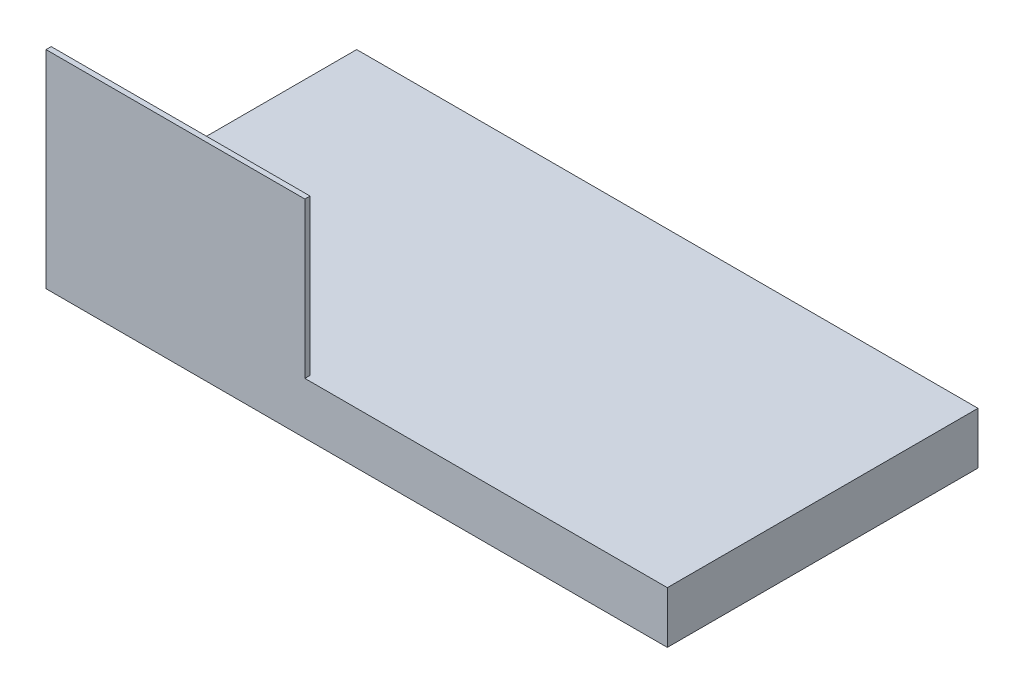
ISO-10303-21;
HEADER;
FILE_DESCRIPTION(('STEP AP214'),'2;1');
FILE_NAME('part.step','',(''),(''),'','','');
FILE_SCHEMA(('AUTOMOTIVE_DESIGN { 1 0 10303 214 1 1 1 1 }'));
ENDSEC;
DATA;
#1=APPLICATION_CONTEXT('core data for automotive mechanical design processes');
#2=APPLICATION_PROTOCOL_DEFINITION('international standard','automotive_design',2000,#1);
#3=PRODUCT_CONTEXT('',#1,'mechanical');
#4=PRODUCT('Part','Part','',(#3));
#5=PRODUCT_RELATED_PRODUCT_CATEGORY('part','',(#4));
#6=PRODUCT_DEFINITION_FORMATION('','',#4);
#7=PRODUCT_DEFINITION_CONTEXT('part definition',#1,'design');
#8=PRODUCT_DEFINITION('design','',#6,#7);
#9=PRODUCT_DEFINITION_SHAPE('','',#8);
#10=(LENGTH_UNIT() NAMED_UNIT(*) SI_UNIT(.MILLI.,.METRE.));
#11=(NAMED_UNIT(*) PLANE_ANGLE_UNIT() SI_UNIT($,.RADIAN.));
#12=(NAMED_UNIT(*) SI_UNIT($,.STERADIAN.) SOLID_ANGLE_UNIT());
#13=UNCERTAINTY_MEASURE_WITH_UNIT(LENGTH_MEASURE(1.E-05),#10,'distance_accuracy_value','');
#14=(GEOMETRIC_REPRESENTATION_CONTEXT(3) GLOBAL_UNCERTAINTY_ASSIGNED_CONTEXT((#13)) GLOBAL_UNIT_ASSIGNED_CONTEXT((#10,
#11,#12)) REPRESENTATION_CONTEXT('',''));
#15=CARTESIAN_POINT('',(0.,0.,0.));
#16=DIRECTION('',(0.,0.,1.));
#17=DIRECTION('',(1.,0.,0.));
#18=AXIS2_PLACEMENT_3D('',#15,#16,#17);
#19=CARTESIAN_POINT('',(-60.,10.,-30.));
#20=DIRECTION('',(1.,0.,0.));
#21=DIRECTION('',(0.,0.,-1.));
#22=AXIS2_PLACEMENT_3D('',#19,#20,#21);
#23=PLANE('',#22);
#24=DIRECTION('',(0.,0.,1.));
#25=VECTOR('',#24,1.);
#26=CARTESIAN_POINT('',(-60.,0.,-30.));
#27=LINE('',#26,#25);
#28=CARTESIAN_POINT('',(-60.,0.,-30.));
#29=VERTEX_POINT('',#28);
#30=CARTESIAN_POINT('',(-60.,0.,30.));
#31=VERTEX_POINT('',#30);
#32=EDGE_CURVE('E114',#29,#31,#27,.T.);
#33=ORIENTED_EDGE('',*,*,#32,.T.);
#34=DIRECTION('',(0.,-1.,0.));
#35=VECTOR('',#34,1.);
#36=CARTESIAN_POINT('',(-60.,10.,30.));
#37=LINE('',#36,#35);
#38=CARTESIAN_POINT('',(-60.,40.,30.));
#39=VERTEX_POINT('',#38);
#40=EDGE_CURVE('E11',#39,#31,#37,.T.);
#41=ORIENTED_EDGE('',*,*,#40,.F.);
#42=DIRECTION('',(0.,0.,-1.));
#43=VECTOR('',#42,1.);
#44=CARTESIAN_POINT('',(-60.,40.,30.));
#45=LINE('',#44,#43);
#46=CARTESIAN_POINT('',(-60.,40.,29.));
#47=VERTEX_POINT('',#46);
#48=EDGE_CURVE('E109',#39,#47,#45,.T.);
#49=ORIENTED_EDGE('',*,*,#48,.T.);
#50=DIRECTION('',(0.,-1.,0.));
#51=VECTOR('',#50,1.);
#52=CARTESIAN_POINT('',(-60.,40.,29.));
#53=LINE('',#52,#51);
#54=CARTESIAN_POINT('',(-60.,10.,29.));
#55=VERTEX_POINT('',#54);
#56=EDGE_CURVE('E123',#47,#55,#53,.T.);
#57=ORIENTED_EDGE('',*,*,#56,.T.);
#58=DIRECTION('',(0.,0.,1.));
#59=VECTOR('',#58,1.);
#60=CARTESIAN_POINT('',(-60.,10.,-30.));
#61=LINE('',#60,#59);
#62=CARTESIAN_POINT('',(-60.,10.,-30.));
#63=VERTEX_POINT('',#62);
#64=EDGE_CURVE('E130',#63,#55,#61,.T.);
#65=ORIENTED_EDGE('',*,*,#64,.F.);
#66=DIRECTION('',(0.,-1.,0.));
#67=VECTOR('',#66,1.);
#68=CARTESIAN_POINT('',(-60.,10.,-30.));
#69=LINE('',#68,#67);
#70=EDGE_CURVE('E136',#63,#29,#69,.T.);
#71=ORIENTED_EDGE('',*,*,#70,.T.);
#72=EDGE_LOOP('',(#33,#41,#49,#57,#65,#71));
#73=FACE_BOUND('',#72,.T.);
#74=ADVANCED_FACE('F33',(#73),#23,.F.);
#75=CARTESIAN_POINT('',(60.,10.,30.));
#76=DIRECTION('',(0.,0.,-1.));
#77=DIRECTION('',(-1.,0.,0.));
#78=AXIS2_PLACEMENT_3D('',#75,#76,#77);
#79=PLANE('',#78);
#80=DIRECTION('',(1.,0.,0.));
#81=VECTOR('',#80,1.);
#82=CARTESIAN_POINT('',(60.,0.,30.));
#83=LINE('',#82,#81);
#84=CARTESIAN_POINT('',(60.,0.,30.));
#85=VERTEX_POINT('',#84);
#86=EDGE_CURVE('E139',#31,#85,#83,.T.);
#87=ORIENTED_EDGE('',*,*,#86,.T.);
#88=DIRECTION('',(0.,-1.,0.));
#89=VECTOR('',#88,1.);
#90=CARTESIAN_POINT('',(60.,10.,30.));
#91=LINE('',#90,#89);
#92=CARTESIAN_POINT('',(60.,10.,30.));
#93=VERTEX_POINT('',#92);
#94=EDGE_CURVE('E40',#93,#85,#91,.T.);
#95=ORIENTED_EDGE('',*,*,#94,.F.);
#96=DIRECTION('',(1.,0.,0.));
#97=VECTOR('',#96,1.);
#98=CARTESIAN_POINT('',(60.,10.,30.));
#99=LINE('',#98,#97);
#100=CARTESIAN_POINT('',(-9.99999999999997,10.,30.));
#101=VERTEX_POINT('',#100);
#102=EDGE_CURVE('E80',#101,#93,#99,.T.);
#103=ORIENTED_EDGE('',*,*,#102,.F.);
#104=DIRECTION('',(0.,-1.,0.));
#105=VECTOR('',#104,1.);
#106=CARTESIAN_POINT('',(-9.99999999999997,40.,30.));
#107=LINE('',#106,#105);
#108=CARTESIAN_POINT('',(-9.99999999999997,40.,30.));
#109=VERTEX_POINT('',#108);
#110=EDGE_CURVE('E47',#109,#101,#107,.T.);
#111=ORIENTED_EDGE('',*,*,#110,.F.);
#112=DIRECTION('',(1.,0.,0.));
#113=VECTOR('',#112,1.);
#114=CARTESIAN_POINT('',(-60.,40.,30.));
#115=LINE('',#114,#113);
#116=EDGE_CURVE('E103',#39,#109,#115,.T.);
#117=ORIENTED_EDGE('',*,*,#116,.F.);
#118=ORIENTED_EDGE('',*,*,#40,.T.);
#119=EDGE_LOOP('',(#87,#95,#103,#111,#117,#118));
#120=FACE_BOUND('',#119,.T.);
#121=ADVANCED_FACE('F113',(#120),#79,.F.);
#122=CARTESIAN_POINT('',(60.,10.,-30.));
#123=DIRECTION('',(-1.,0.,0.));
#124=DIRECTION('',(0.,0.,1.));
#125=AXIS2_PLACEMENT_3D('',#122,#123,#124);
#126=PLANE('',#125);
#127=DIRECTION('',(0.,0.,-1.));
#128=VECTOR('',#127,1.);
#129=CARTESIAN_POINT('',(60.,0.,-30.));
#130=LINE('',#129,#128);
#131=CARTESIAN_POINT('',(60.,0.,-30.));
#132=VERTEX_POINT('',#131);
#133=EDGE_CURVE('E141',#85,#132,#130,.T.);
#134=ORIENTED_EDGE('',*,*,#133,.T.);
#135=DIRECTION('',(0.,-1.,0.));
#136=VECTOR('',#135,1.);
#137=CARTESIAN_POINT('',(60.,10.,-30.));
#138=LINE('',#137,#136);
#139=CARTESIAN_POINT('',(60.,10.,-30.));
#140=VERTEX_POINT('',#139);
#141=EDGE_CURVE('E145',#140,#132,#138,.T.);
#142=ORIENTED_EDGE('',*,*,#141,.F.);
#143=DIRECTION('',(0.,0.,-1.));
#144=VECTOR('',#143,1.);
#145=CARTESIAN_POINT('',(60.,10.,-30.));
#146=LINE('',#145,#144);
#147=EDGE_CURVE('E133',#93,#140,#146,.T.);
#148=ORIENTED_EDGE('',*,*,#147,.F.);
#149=ORIENTED_EDGE('',*,*,#94,.T.);
#150=EDGE_LOOP('',(#134,#142,#148,#149));
#151=FACE_BOUND('',#150,.T.);
#152=ADVANCED_FACE('F150',(#151),#126,.F.);
#153=CARTESIAN_POINT('',(60.,10.,-30.));
#154=DIRECTION('',(0.,0.,1.));
#155=DIRECTION('',(1.,0.,0.));
#156=AXIS2_PLACEMENT_3D('',#153,#154,#155);
#157=PLANE('',#156);
#158=DIRECTION('',(-1.,0.,0.));
#159=VECTOR('',#158,1.);
#160=CARTESIAN_POINT('',(60.,0.,-30.));
#161=LINE('',#160,#159);
#162=EDGE_CURVE('E76',#132,#29,#161,.T.);
#163=ORIENTED_EDGE('',*,*,#162,.T.);
#164=ORIENTED_EDGE('',*,*,#70,.F.);
#165=DIRECTION('',(-1.,0.,0.));
#166=VECTOR('',#165,1.);
#167=CARTESIAN_POINT('',(60.,10.,-30.));
#168=LINE('',#167,#166);
#169=EDGE_CURVE('E56',#140,#63,#168,.T.);
#170=ORIENTED_EDGE('',*,*,#169,.F.);
#171=ORIENTED_EDGE('',*,*,#141,.T.);
#172=EDGE_LOOP('',(#163,#164,#170,#171));
#173=FACE_BOUND('',#172,.T.);
#174=ADVANCED_FACE('F157',(#173),#157,.F.);
#175=CARTESIAN_POINT('',(0.,10.,0.));
#176=DIRECTION('',(0.,-1.,0.));
#177=DIRECTION('',(0.,0.,-1.));
#178=AXIS2_PLACEMENT_3D('',#175,#176,#177);
#179=PLANE('',#178);
#180=ORIENTED_EDGE('',*,*,#64,.T.);
#181=DIRECTION('',(1.,0.,0.));
#182=VECTOR('',#181,1.);
#183=CARTESIAN_POINT('',(-60.,10.,29.));
#184=LINE('',#183,#182);
#185=CARTESIAN_POINT('',(-9.99999999999997,10.,29.));
#186=VERTEX_POINT('',#185);
#187=EDGE_CURVE('E111',#55,#186,#184,.T.);
#188=ORIENTED_EDGE('',*,*,#187,.T.);
#189=DIRECTION('',(0.,0.,1.));
#190=VECTOR('',#189,1.);
#191=CARTESIAN_POINT('',(-9.99999999999997,10.,29.));
#192=LINE('',#191,#190);
#193=EDGE_CURVE('E124',#186,#101,#192,.T.);
#194=ORIENTED_EDGE('',*,*,#193,.T.);
#195=ORIENTED_EDGE('',*,*,#102,.T.);
#196=ORIENTED_EDGE('',*,*,#147,.T.);
#197=ORIENTED_EDGE('',*,*,#169,.T.);
#198=EDGE_LOOP('',(#180,#188,#194,#195,#196,#197));
#199=FACE_BOUND('',#198,.T.);
#200=ADVANCED_FACE('F159',(#199),#179,.F.);
#201=CARTESIAN_POINT('',(0.,0.,0.));
#202=DIRECTION('',(0.,-1.,0.));
#203=DIRECTION('',(0.,0.,-1.));
#204=AXIS2_PLACEMENT_3D('',#201,#202,#203);
#205=PLANE('',#204);
#206=ORIENTED_EDGE('',*,*,#32,.F.);
#207=ORIENTED_EDGE('',*,*,#162,.F.);
#208=ORIENTED_EDGE('',*,*,#133,.F.);
#209=ORIENTED_EDGE('',*,*,#86,.F.);
#210=EDGE_LOOP('',(#206,#207,#208,#209));
#211=FACE_BOUND('',#210,.T.);
#212=ADVANCED_FACE('F154',(#211),#205,.T.);
#213=CARTESIAN_POINT('',(-9.99999999999997,40.,29.));
#214=DIRECTION('',(1.,0.,0.));
#215=DIRECTION('',(0.,0.,-1.));
#216=AXIS2_PLACEMENT_3D('',#213,#214,#215);
#217=PLANE('',#216);
#218=ORIENTED_EDGE('',*,*,#193,.F.);
#219=DIRECTION('',(0.,-1.,0.));
#220=VECTOR('',#219,1.);
#221=CARTESIAN_POINT('',(-9.99999999999997,40.,29.));
#222=LINE('',#221,#220);
#223=CARTESIAN_POINT('',(-9.99999999999997,40.,29.));
#224=VERTEX_POINT('',#223);
#225=EDGE_CURVE('E115',#224,#186,#222,.T.);
#226=ORIENTED_EDGE('',*,*,#225,.F.);
#227=DIRECTION('',(0.,0.,1.));
#228=VECTOR('',#227,1.);
#229=CARTESIAN_POINT('',(-9.99999999999997,40.,29.));
#230=LINE('',#229,#228);
#231=EDGE_CURVE('E106',#224,#109,#230,.T.);
#232=ORIENTED_EDGE('',*,*,#231,.T.);
#233=ORIENTED_EDGE('',*,*,#110,.T.);
#234=EDGE_LOOP('',(#218,#226,#232,#233));
#235=FACE_BOUND('',#234,.T.);
#236=ADVANCED_FACE('F117',(#235),#217,.T.);
#237=CARTESIAN_POINT('',(-60.,40.,29.));
#238=DIRECTION('',(0.,0.,-1.));
#239=DIRECTION('',(-1.,0.,0.));
#240=AXIS2_PLACEMENT_3D('',#237,#238,#239);
#241=PLANE('',#240);
#242=ORIENTED_EDGE('',*,*,#187,.F.);
#243=ORIENTED_EDGE('',*,*,#56,.F.);
#244=DIRECTION('',(1.,0.,0.));
#245=VECTOR('',#244,1.);
#246=CARTESIAN_POINT('',(-60.,40.,29.));
#247=LINE('',#246,#245);
#248=EDGE_CURVE('E118',#47,#224,#247,.T.);
#249=ORIENTED_EDGE('',*,*,#248,.T.);
#250=ORIENTED_EDGE('',*,*,#225,.T.);
#251=EDGE_LOOP('',(#242,#243,#249,#250));
#252=FACE_BOUND('',#251,.T.);
#253=ADVANCED_FACE('F213',(#252),#241,.T.);
#254=CARTESIAN_POINT('',(0.,40.,0.));
#255=DIRECTION('',(0.,-1.,0.));
#256=DIRECTION('',(-1.,0.,0.));
#257=AXIS2_PLACEMENT_3D('',#254,#255,#256);
#258=PLANE('',#257);
#259=ORIENTED_EDGE('',*,*,#116,.T.);
#260=ORIENTED_EDGE('',*,*,#231,.F.);
#261=ORIENTED_EDGE('',*,*,#248,.F.);
#262=ORIENTED_EDGE('',*,*,#48,.F.);
#263=EDGE_LOOP('',(#259,#260,#261,#262));
#264=FACE_BOUND('',#263,.T.);
#265=ADVANCED_FACE('F104',(#264),#258,.F.);
#266=CLOSED_SHELL('',(#74,#121,#152,#174,#200,#212,#236,#253,#265));
#267=MANIFOLD_SOLID_BREP('B2',#266);
#268=ADVANCED_BREP_SHAPE_REPRESENTATION('',(#18,#267),#14);
#269=SHAPE_DEFINITION_REPRESENTATION(#9,#268);
ENDSEC;
END-ISO-10303-21;
